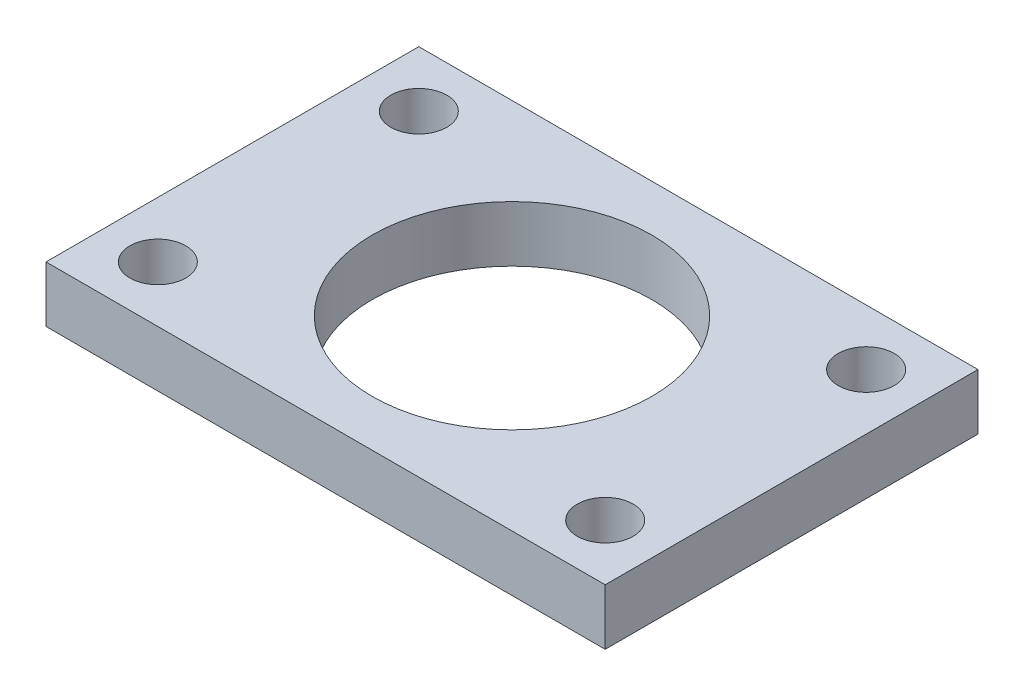
ISO-10303-21;
HEADER;
FILE_DESCRIPTION(('STEP AP214'),'2;1');
FILE_NAME('part.step','',(''),(''),'','','');
FILE_SCHEMA(('AUTOMOTIVE_DESIGN { 1 0 10303 214 1 1 1 1 }'));
ENDSEC;
DATA;
#1=APPLICATION_CONTEXT('core data for automotive mechanical design processes');
#2=APPLICATION_PROTOCOL_DEFINITION('international standard','automotive_design',2000,#1);
#3=PRODUCT_CONTEXT('',#1,'mechanical');
#4=PRODUCT('Part','Part','',(#3));
#5=PRODUCT_RELATED_PRODUCT_CATEGORY('part','',(#4));
#6=PRODUCT_DEFINITION_FORMATION('','',#4);
#7=PRODUCT_DEFINITION_CONTEXT('part definition',#1,'design');
#8=PRODUCT_DEFINITION('design','',#6,#7);
#9=PRODUCT_DEFINITION_SHAPE('','',#8);
#10=(LENGTH_UNIT() NAMED_UNIT(*) SI_UNIT(.MILLI.,.METRE.));
#11=(NAMED_UNIT(*) PLANE_ANGLE_UNIT() SI_UNIT($,.RADIAN.));
#12=(NAMED_UNIT(*) SI_UNIT($,.STERADIAN.) SOLID_ANGLE_UNIT());
#13=UNCERTAINTY_MEASURE_WITH_UNIT(LENGTH_MEASURE(1.E-05),#10,'distance_accuracy_value','');
#14=(GEOMETRIC_REPRESENTATION_CONTEXT(3) GLOBAL_UNCERTAINTY_ASSIGNED_CONTEXT((#13)) GLOBAL_UNIT_ASSIGNED_CONTEXT((#10,
#11,#12)) REPRESENTATION_CONTEXT('',''));
#15=CARTESIAN_POINT('',(0.,0.,0.));
#16=DIRECTION('',(0.,0.,1.));
#17=DIRECTION('',(1.,0.,0.));
#18=AXIS2_PLACEMENT_3D('',#15,#16,#17);
#19=CARTESIAN_POINT('',(0.,3.,0.));
#20=DIRECTION('',(0.,1.,0.));
#21=DIRECTION('',(0.,0.,1.));
#22=AXIS2_PLACEMENT_3D('',#19,#20,#21);
#23=PLANE('',#22);
#24=CARTESIAN_POINT('',(-3.,3.,-17.));
#25=DIRECTION('',(0.,1.,0.));
#26=DIRECTION('',(0.,0.,1.));
#27=AXIS2_PLACEMENT_3D('',#24,#25,#26);
#28=CIRCLE('',#27,1.5);
#29=CARTESIAN_POINT('',(-3.,3.,-15.5));
#30=VERTEX_POINT('',#29);
#31=EDGE_CURVE('E119',#30,#30,#28,.F.);
#32=ORIENTED_EDGE('',*,*,#31,.T.);
#33=EDGE_LOOP('',(#32));
#34=FACE_BOUND('',#33,.T.);
#35=CARTESIAN_POINT('',(-27.,3.,-3.));
#36=DIRECTION('',(0.,1.,0.));
#37=DIRECTION('',(0.,0.,1.));
#38=AXIS2_PLACEMENT_3D('',#35,#36,#37);
#39=CIRCLE('',#38,1.5);
#40=CARTESIAN_POINT('',(-27.,3.,-1.49999999999999));
#41=VERTEX_POINT('',#40);
#42=EDGE_CURVE('E112',#41,#41,#39,.F.);
#43=ORIENTED_EDGE('',*,*,#42,.T.);
#44=EDGE_LOOP('',(#43));
#45=FACE_BOUND('',#44,.T.);
#46=DIRECTION('',(0.,0.,-1.));
#47=VECTOR('',#46,1.);
#48=CARTESIAN_POINT('',(0.,3.,0.));
#49=LINE('',#48,#47);
#50=CARTESIAN_POINT('',(0.,3.,0.));
#51=VERTEX_POINT('',#50);
#52=CARTESIAN_POINT('',(0.,3.,-20.));
#53=VERTEX_POINT('',#52);
#54=EDGE_CURVE('E87',#51,#53,#49,.T.);
#55=ORIENTED_EDGE('',*,*,#54,.T.);
#56=DIRECTION('',(-1.,0.,0.));
#57=VECTOR('',#56,1.);
#58=CARTESIAN_POINT('',(0.,3.,-20.));
#59=LINE('',#58,#57);
#60=CARTESIAN_POINT('',(-30.,3.,-20.));
#61=VERTEX_POINT('',#60);
#62=EDGE_CURVE('E82',#53,#61,#59,.T.);
#63=ORIENTED_EDGE('',*,*,#62,.T.);
#64=DIRECTION('',(0.,0.,1.));
#65=VECTOR('',#64,1.);
#66=CARTESIAN_POINT('',(-30.,3.,0.));
#67=LINE('',#66,#65);
#68=CARTESIAN_POINT('',(-30.,3.,0.));
#69=VERTEX_POINT('',#68);
#70=EDGE_CURVE('E85',#61,#69,#67,.T.);
#71=ORIENTED_EDGE('',*,*,#70,.T.);
#72=DIRECTION('',(1.,0.,0.));
#73=VECTOR('',#72,1.);
#74=CARTESIAN_POINT('',(0.,3.,0.));
#75=LINE('',#74,#73);
#76=EDGE_CURVE('E52',#69,#51,#75,.T.);
#77=ORIENTED_EDGE('',*,*,#76,.T.);
#78=EDGE_LOOP('',(#55,#63,#71,#77));
#79=FACE_BOUND('',#78,.T.);
#80=CARTESIAN_POINT('',(-27.,3.,-17.));
#81=DIRECTION('',(0.,1.,0.));
#82=DIRECTION('',(0.,0.,1.));
#83=AXIS2_PLACEMENT_3D('',#80,#81,#82);
#84=CIRCLE('',#83,1.5);
#85=CARTESIAN_POINT('',(-27.,3.,-15.5));
#86=VERTEX_POINT('',#85);
#87=EDGE_CURVE('E103',#86,#86,#84,.F.);
#88=ORIENTED_EDGE('',*,*,#87,.T.);
#89=EDGE_LOOP('',(#88));
#90=FACE_BOUND('',#89,.T.);
#91=CARTESIAN_POINT('',(-3.,3.,-3.));
#92=DIRECTION('',(0.,1.,0.));
#93=DIRECTION('',(0.,0.,1.));
#94=AXIS2_PLACEMENT_3D('',#91,#92,#93);
#95=CIRCLE('',#94,1.5);
#96=CARTESIAN_POINT('',(-3.,3.,-1.5));
#97=VERTEX_POINT('',#96);
#98=EDGE_CURVE('E116',#97,#97,#95,.F.);
#99=ORIENTED_EDGE('',*,*,#98,.T.);
#100=EDGE_LOOP('',(#99));
#101=FACE_BOUND('',#100,.T.);
#102=CARTESIAN_POINT('',(-15.,3.,-10.));
#103=DIRECTION('',(0.,1.,0.));
#104=DIRECTION('',(0.,0.,1.));
#105=AXIS2_PLACEMENT_3D('',#102,#103,#104);
#106=CIRCLE('',#105,7.5);
#107=CARTESIAN_POINT('',(-15.,3.,-2.5));
#108=VERTEX_POINT('',#107);
#109=EDGE_CURVE('E122',#108,#108,#106,.F.);
#110=ORIENTED_EDGE('',*,*,#109,.T.);
#111=EDGE_LOOP('',(#110));
#112=FACE_BOUND('',#111,.T.);
#113=ADVANCED_FACE('F33',(#34,#45,#79,#90,#101,#112),#23,.T.);
#114=CARTESIAN_POINT('',(0.,0.,0.));
#115=DIRECTION('',(0.,1.,0.));
#116=DIRECTION('',(0.,0.,1.));
#117=AXIS2_PLACEMENT_3D('',#114,#115,#116);
#118=PLANE('',#117);
#119=CARTESIAN_POINT('',(-3.,0.,-17.));
#120=DIRECTION('',(0.,1.,0.));
#121=DIRECTION('',(0.,0.,1.));
#122=AXIS2_PLACEMENT_3D('',#119,#120,#121);
#123=CIRCLE('',#122,1.5);
#124=CARTESIAN_POINT('',(-3.,0.,-15.5));
#125=VERTEX_POINT('',#124);
#126=EDGE_CURVE('E120',#125,#125,#123,.F.);
#127=ORIENTED_EDGE('',*,*,#126,.F.);
#128=EDGE_LOOP('',(#127));
#129=FACE_BOUND('',#128,.T.);
#130=CARTESIAN_POINT('',(-27.,0.,-3.));
#131=DIRECTION('',(0.,1.,0.));
#132=DIRECTION('',(0.,0.,1.));
#133=AXIS2_PLACEMENT_3D('',#130,#131,#132);
#134=CIRCLE('',#133,1.5);
#135=CARTESIAN_POINT('',(-27.,0.,-1.49999999999999));
#136=VERTEX_POINT('',#135);
#137=EDGE_CURVE('E113',#136,#136,#134,.F.);
#138=ORIENTED_EDGE('',*,*,#137,.F.);
#139=EDGE_LOOP('',(#138));
#140=FACE_BOUND('',#139,.T.);
#141=DIRECTION('',(0.,0.,-1.));
#142=VECTOR('',#141,1.);
#143=CARTESIAN_POINT('',(0.,0.,0.));
#144=LINE('',#143,#142);
#145=CARTESIAN_POINT('',(0.,0.,0.));
#146=VERTEX_POINT('',#145);
#147=CARTESIAN_POINT('',(0.,0.,-20.));
#148=VERTEX_POINT('',#147);
#149=EDGE_CURVE('E100',#146,#148,#144,.T.);
#150=ORIENTED_EDGE('',*,*,#149,.F.);
#151=DIRECTION('',(1.,0.,0.));
#152=VECTOR('',#151,1.);
#153=CARTESIAN_POINT('',(0.,0.,0.));
#154=LINE('',#153,#152);
#155=CARTESIAN_POINT('',(-30.,0.,0.));
#156=VERTEX_POINT('',#155);
#157=EDGE_CURVE('E75',#156,#146,#154,.T.);
#158=ORIENTED_EDGE('',*,*,#157,.F.);
#159=DIRECTION('',(0.,0.,1.));
#160=VECTOR('',#159,1.);
#161=CARTESIAN_POINT('',(-30.,0.,0.));
#162=LINE('',#161,#160);
#163=CARTESIAN_POINT('',(-30.,0.,-20.));
#164=VERTEX_POINT('',#163);
#165=EDGE_CURVE('E69',#164,#156,#162,.T.);
#166=ORIENTED_EDGE('',*,*,#165,.F.);
#167=DIRECTION('',(-1.,0.,0.));
#168=VECTOR('',#167,1.);
#169=CARTESIAN_POINT('',(0.,0.,-20.));
#170=LINE('',#169,#168);
#171=EDGE_CURVE('E91',#148,#164,#170,.T.);
#172=ORIENTED_EDGE('',*,*,#171,.F.);
#173=EDGE_LOOP('',(#150,#158,#166,#172));
#174=FACE_BOUND('',#173,.T.);
#175=CARTESIAN_POINT('',(-27.,0.,-17.));
#176=DIRECTION('',(0.,1.,0.));
#177=DIRECTION('',(0.,0.,1.));
#178=AXIS2_PLACEMENT_3D('',#175,#176,#177);
#179=CIRCLE('',#178,1.5);
#180=CARTESIAN_POINT('',(-27.,0.,-15.5));
#181=VERTEX_POINT('',#180);
#182=EDGE_CURVE('E109',#181,#181,#179,.F.);
#183=ORIENTED_EDGE('',*,*,#182,.F.);
#184=EDGE_LOOP('',(#183));
#185=FACE_BOUND('',#184,.T.);
#186=CARTESIAN_POINT('',(-3.,0.,-3.));
#187=DIRECTION('',(0.,1.,0.));
#188=DIRECTION('',(0.,0.,1.));
#189=AXIS2_PLACEMENT_3D('',#186,#187,#188);
#190=CIRCLE('',#189,1.5);
#191=CARTESIAN_POINT('',(-3.,0.,-1.5));
#192=VERTEX_POINT('',#191);
#193=EDGE_CURVE('E117',#192,#192,#190,.F.);
#194=ORIENTED_EDGE('',*,*,#193,.F.);
#195=EDGE_LOOP('',(#194));
#196=FACE_BOUND('',#195,.T.);
#197=CARTESIAN_POINT('',(-15.,0.,-10.));
#198=DIRECTION('',(0.,1.,0.));
#199=DIRECTION('',(0.,0.,1.));
#200=AXIS2_PLACEMENT_3D('',#197,#198,#199);
#201=CIRCLE('',#200,7.5);
#202=CARTESIAN_POINT('',(-15.,0.,-2.5));
#203=VERTEX_POINT('',#202);
#204=EDGE_CURVE('E37',#203,#203,#201,.F.);
#205=ORIENTED_EDGE('',*,*,#204,.F.);
#206=EDGE_LOOP('',(#205));
#207=FACE_BOUND('',#206,.T.);
#208=ADVANCED_FACE('F149',(#129,#140,#174,#185,#196,#207),#118,.F.);
#209=CARTESIAN_POINT('',(0.,3.,0.));
#210=DIRECTION('',(-1.,0.,0.));
#211=DIRECTION('',(0.,0.,1.));
#212=AXIS2_PLACEMENT_3D('',#209,#210,#211);
#213=PLANE('',#212);
#214=ORIENTED_EDGE('',*,*,#149,.T.);
#215=DIRECTION('',(0.,-1.,0.));
#216=VECTOR('',#215,1.);
#217=CARTESIAN_POINT('',(0.,3.,-20.));
#218=LINE('',#217,#216);
#219=EDGE_CURVE('E11',#53,#148,#218,.T.);
#220=ORIENTED_EDGE('',*,*,#219,.F.);
#221=ORIENTED_EDGE('',*,*,#54,.F.);
#222=DIRECTION('',(0.,-1.,0.));
#223=VECTOR('',#222,1.);
#224=CARTESIAN_POINT('',(0.,3.,0.));
#225=LINE('',#224,#223);
#226=EDGE_CURVE('E96',#51,#146,#225,.T.);
#227=ORIENTED_EDGE('',*,*,#226,.T.);
#228=EDGE_LOOP('',(#214,#220,#221,#227));
#229=FACE_BOUND('',#228,.T.);
#230=ADVANCED_FACE('F35',(#229),#213,.F.);
#231=CARTESIAN_POINT('',(0.,3.,-20.));
#232=DIRECTION('',(0.,0.,1.));
#233=DIRECTION('',(1.,0.,0.));
#234=AXIS2_PLACEMENT_3D('',#231,#232,#233);
#235=PLANE('',#234);
#236=ORIENTED_EDGE('',*,*,#171,.T.);
#237=DIRECTION('',(0.,-1.,0.));
#238=VECTOR('',#237,1.);
#239=CARTESIAN_POINT('',(-30.,3.,-20.));
#240=LINE('',#239,#238);
#241=EDGE_CURVE('E43',#61,#164,#240,.T.);
#242=ORIENTED_EDGE('',*,*,#241,.F.);
#243=ORIENTED_EDGE('',*,*,#62,.F.);
#244=ORIENTED_EDGE('',*,*,#219,.T.);
#245=EDGE_LOOP('',(#236,#242,#243,#244));
#246=FACE_BOUND('',#245,.T.);
#247=ADVANCED_FACE('F90',(#246),#235,.F.);
#248=CARTESIAN_POINT('',(-30.,3.,0.));
#249=DIRECTION('',(1.,0.,0.));
#250=DIRECTION('',(0.,0.,-1.));
#251=AXIS2_PLACEMENT_3D('',#248,#249,#250);
#252=PLANE('',#251);
#253=ORIENTED_EDGE('',*,*,#165,.T.);
#254=DIRECTION('',(0.,-1.,0.));
#255=VECTOR('',#254,1.);
#256=CARTESIAN_POINT('',(-30.,3.,0.));
#257=LINE('',#256,#255);
#258=EDGE_CURVE('E92',#69,#156,#257,.T.);
#259=ORIENTED_EDGE('',*,*,#258,.F.);
#260=ORIENTED_EDGE('',*,*,#70,.F.);
#261=ORIENTED_EDGE('',*,*,#241,.T.);
#262=EDGE_LOOP('',(#253,#259,#260,#261));
#263=FACE_BOUND('',#262,.T.);
#264=ADVANCED_FACE('F94',(#263),#252,.F.);
#265=CARTESIAN_POINT('',(0.,3.,0.));
#266=DIRECTION('',(0.,0.,-1.));
#267=DIRECTION('',(-1.,0.,0.));
#268=AXIS2_PLACEMENT_3D('',#265,#266,#267);
#269=PLANE('',#268);
#270=ORIENTED_EDGE('',*,*,#157,.T.);
#271=ORIENTED_EDGE('',*,*,#226,.F.);
#272=ORIENTED_EDGE('',*,*,#76,.F.);
#273=ORIENTED_EDGE('',*,*,#258,.T.);
#274=EDGE_LOOP('',(#270,#271,#272,#273));
#275=FACE_BOUND('',#274,.T.);
#276=ADVANCED_FACE('F145',(#275),#269,.F.);
#277=CARTESIAN_POINT('',(-27.,6.,-17.));
#278=DIRECTION('',(0.,-1.,0.));
#279=DIRECTION('',(0.,0.,-1.));
#280=AXIS2_PLACEMENT_3D('',#277,#278,#279);
#281=CYLINDRICAL_SURFACE('',#280,1.5);
#282=ORIENTED_EDGE('',*,*,#87,.F.);
#283=EDGE_LOOP('',(#282));
#284=FACE_BOUND('',#283,.T.);
#285=ORIENTED_EDGE('',*,*,#182,.T.);
#286=EDGE_LOOP('',(#285));
#287=FACE_BOUND('',#286,.T.);
#288=ADVANCED_FACE('F141',(#284,#287),#281,.F.);
#289=CARTESIAN_POINT('',(-27.,6.,-3.));
#290=DIRECTION('',(0.,-1.,0.));
#291=DIRECTION('',(0.,0.,-1.));
#292=AXIS2_PLACEMENT_3D('',#289,#290,#291);
#293=CYLINDRICAL_SURFACE('',#292,1.5);
#294=ORIENTED_EDGE('',*,*,#42,.F.);
#295=EDGE_LOOP('',(#294));
#296=FACE_BOUND('',#295,.T.);
#297=ORIENTED_EDGE('',*,*,#137,.T.);
#298=EDGE_LOOP('',(#297));
#299=FACE_BOUND('',#298,.T.);
#300=ADVANCED_FACE('F144',(#296,#299),#293,.F.);
#301=CARTESIAN_POINT('',(-3.,6.,-3.));
#302=DIRECTION('',(0.,-1.,0.));
#303=DIRECTION('',(0.,0.,-1.));
#304=AXIS2_PLACEMENT_3D('',#301,#302,#303);
#305=CYLINDRICAL_SURFACE('',#304,1.5);
#306=ORIENTED_EDGE('',*,*,#98,.F.);
#307=EDGE_LOOP('',(#306));
#308=FACE_BOUND('',#307,.T.);
#309=ORIENTED_EDGE('',*,*,#193,.T.);
#310=EDGE_LOOP('',(#309));
#311=FACE_BOUND('',#310,.T.);
#312=ADVANCED_FACE('F166',(#308,#311),#305,.F.);
#313=CARTESIAN_POINT('',(-3.,6.,-17.));
#314=DIRECTION('',(0.,-1.,0.));
#315=DIRECTION('',(0.,0.,-1.));
#316=AXIS2_PLACEMENT_3D('',#313,#314,#315);
#317=CYLINDRICAL_SURFACE('',#316,1.5);
#318=ORIENTED_EDGE('',*,*,#31,.F.);
#319=EDGE_LOOP('',(#318));
#320=FACE_BOUND('',#319,.T.);
#321=ORIENTED_EDGE('',*,*,#126,.T.);
#322=EDGE_LOOP('',(#321));
#323=FACE_BOUND('',#322,.T.);
#324=ADVANCED_FACE('F160',(#320,#323),#317,.F.);
#325=CARTESIAN_POINT('',(-15.,6.,-10.));
#326=DIRECTION('',(0.,-1.,0.));
#327=DIRECTION('',(0.,0.,-1.));
#328=AXIS2_PLACEMENT_3D('',#325,#326,#327);
#329=CYLINDRICAL_SURFACE('',#328,7.5);
#330=ORIENTED_EDGE('',*,*,#109,.F.);
#331=EDGE_LOOP('',(#330));
#332=FACE_BOUND('',#331,.T.);
#333=ORIENTED_EDGE('',*,*,#204,.T.);
#334=EDGE_LOOP('',(#333));
#335=FACE_BOUND('',#334,.T.);
#336=ADVANCED_FACE('F158',(#332,#335),#329,.F.);
#337=CLOSED_SHELL('',(#113,#208,#230,#247,#264,#276,#288,#300,#312,#324,#336));
#338=MANIFOLD_SOLID_BREP('B2',#337);
#339=ADVANCED_BREP_SHAPE_REPRESENTATION('',(#18,#338),#14);
#340=SHAPE_DEFINITION_REPRESENTATION(#9,#339);
ENDSEC;
END-ISO-10303-21;
